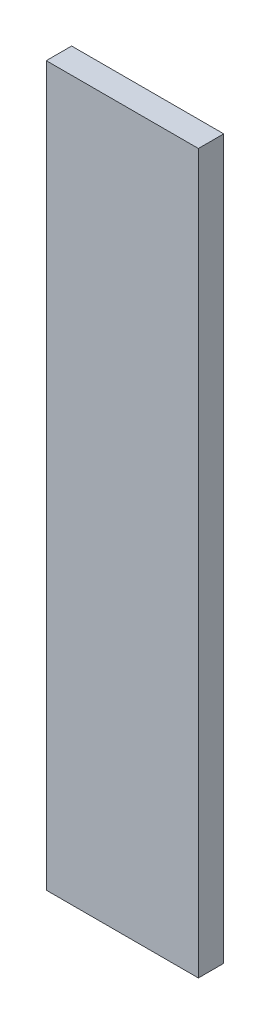
ISO-10303-21;
HEADER;
FILE_DESCRIPTION(('STEP AP214'),'2;1');
FILE_NAME('part.step','',(''),(''),'','','');
FILE_SCHEMA(('AUTOMOTIVE_DESIGN { 1 0 10303 214 1 1 1 1 }'));
ENDSEC;
DATA;
#1=APPLICATION_CONTEXT('core data for automotive mechanical design processes');
#2=APPLICATION_PROTOCOL_DEFINITION('international standard','automotive_design',2000,#1);
#3=PRODUCT_CONTEXT('',#1,'mechanical');
#4=PRODUCT('Part','Part','',(#3));
#5=PRODUCT_RELATED_PRODUCT_CATEGORY('part','',(#4));
#6=PRODUCT_DEFINITION_FORMATION('','',#4);
#7=PRODUCT_DEFINITION_CONTEXT('part definition',#1,'design');
#8=PRODUCT_DEFINITION('design','',#6,#7);
#9=PRODUCT_DEFINITION_SHAPE('','',#8);
#10=(LENGTH_UNIT() NAMED_UNIT(*) SI_UNIT(.MILLI.,.METRE.));
#11=(NAMED_UNIT(*) PLANE_ANGLE_UNIT() SI_UNIT($,.RADIAN.));
#12=(NAMED_UNIT(*) SI_UNIT($,.STERADIAN.) SOLID_ANGLE_UNIT());
#13=UNCERTAINTY_MEASURE_WITH_UNIT(LENGTH_MEASURE(1.E-05),#10,'distance_accuracy_value','');
#14=(GEOMETRIC_REPRESENTATION_CONTEXT(3) GLOBAL_UNCERTAINTY_ASSIGNED_CONTEXT((#13)) GLOBAL_UNIT_ASSIGNED_CONTEXT((#10,
#11,#12)) REPRESENTATION_CONTEXT('',''));
#15=CARTESIAN_POINT('',(0.,0.,0.));
#16=DIRECTION('',(0.,0.,1.));
#17=DIRECTION('',(1.,0.,0.));
#18=AXIS2_PLACEMENT_3D('',#15,#16,#17);
#19=CARTESIAN_POINT('',(-7.73437500000001,7.76953125,3.));
#20=DIRECTION('',(1.,0.,0.));
#21=DIRECTION('',(0.,1.,0.));
#22=AXIS2_PLACEMENT_3D('',#19,#20,#21);
#23=PLANE('',#22);
#24=DIRECTION('',(0.,-1.,0.));
#25=VECTOR('',#24,1.);
#26=CARTESIAN_POINT('',(-7.73437500000001,7.76953125,0.));
#27=LINE('',#26,#25);
#28=CARTESIAN_POINT('',(-7.73437500000001,7.76953125,0.));
#29=VERTEX_POINT('',#28);
#30=CARTESIAN_POINT('',(-7.734375,-77.23046875,0.));
#31=VERTEX_POINT('',#30);
#32=EDGE_CURVE('E96',#29,#31,#27,.T.);
#33=ORIENTED_EDGE('',*,*,#32,.T.);
#34=DIRECTION('',(0.,0.,-1.));
#35=VECTOR('',#34,1.);
#36=CARTESIAN_POINT('',(-7.734375,-77.23046875,3.));
#37=LINE('',#36,#35);
#38=CARTESIAN_POINT('',(-7.734375,-77.23046875,3.));
#39=VERTEX_POINT('',#38);
#40=EDGE_CURVE('E11',#39,#31,#37,.T.);
#41=ORIENTED_EDGE('',*,*,#40,.F.);
#42=DIRECTION('',(0.,-1.,0.));
#43=VECTOR('',#42,1.);
#44=CARTESIAN_POINT('',(-7.73437500000001,7.76953125,3.));
#45=LINE('',#44,#43);
#46=CARTESIAN_POINT('',(-7.73437500000001,7.76953125,3.));
#47=VERTEX_POINT('',#46);
#48=EDGE_CURVE('E84',#47,#39,#45,.T.);
#49=ORIENTED_EDGE('',*,*,#48,.F.);
#50=DIRECTION('',(0.,0.,-1.));
#51=VECTOR('',#50,1.);
#52=CARTESIAN_POINT('',(-7.73437500000001,7.76953125,3.));
#53=LINE('',#52,#51);
#54=EDGE_CURVE('E92',#47,#29,#53,.T.);
#55=ORIENTED_EDGE('',*,*,#54,.T.);
#56=EDGE_LOOP('',(#33,#41,#49,#55));
#57=FACE_BOUND('',#56,.T.);
#58=ADVANCED_FACE('F33',(#57),#23,.F.);
#59=CARTESIAN_POINT('',(-7.734375,-77.23046875,3.));
#60=DIRECTION('',(0.,1.,0.));
#61=DIRECTION('',(0.,0.,1.));
#62=AXIS2_PLACEMENT_3D('',#59,#60,#61);
#63=PLANE('',#62);
#64=DIRECTION('',(1.,0.,0.));
#65=VECTOR('',#64,1.);
#66=CARTESIAN_POINT('',(-7.734375,-77.23046875,0.));
#67=LINE('',#66,#65);
#68=CARTESIAN_POINT('',(10.265625,-77.23046875,0.));
#69=VERTEX_POINT('',#68);
#70=EDGE_CURVE('E88',#31,#69,#67,.T.);
#71=ORIENTED_EDGE('',*,*,#70,.T.);
#72=DIRECTION('',(0.,0.,-1.));
#73=VECTOR('',#72,1.);
#74=CARTESIAN_POINT('',(10.265625,-77.23046875,3.));
#75=LINE('',#74,#73);
#76=CARTESIAN_POINT('',(10.265625,-77.23046875,3.));
#77=VERTEX_POINT('',#76);
#78=EDGE_CURVE('E41',#77,#69,#75,.T.);
#79=ORIENTED_EDGE('',*,*,#78,.F.);
#80=DIRECTION('',(1.,0.,0.));
#81=VECTOR('',#80,1.);
#82=CARTESIAN_POINT('',(-7.734375,-77.23046875,3.));
#83=LINE('',#82,#81);
#84=EDGE_CURVE('E79',#39,#77,#83,.T.);
#85=ORIENTED_EDGE('',*,*,#84,.F.);
#86=ORIENTED_EDGE('',*,*,#40,.T.);
#87=EDGE_LOOP('',(#71,#79,#85,#86));
#88=FACE_BOUND('',#87,.T.);
#89=ADVANCED_FACE('F87',(#88),#63,.F.);
#90=CARTESIAN_POINT('',(10.265625,7.76953125,3.));
#91=DIRECTION('',(-1.,0.,0.));
#92=DIRECTION('',(0.,-1.,0.));
#93=AXIS2_PLACEMENT_3D('',#90,#91,#92);
#94=PLANE('',#93);
#95=DIRECTION('',(0.,1.,0.));
#96=VECTOR('',#95,1.);
#97=CARTESIAN_POINT('',(10.265625,7.76953125,0.));
#98=LINE('',#97,#96);
#99=CARTESIAN_POINT('',(10.265625,7.76953125,0.));
#100=VERTEX_POINT('',#99);
#101=EDGE_CURVE('E66',#69,#100,#98,.T.);
#102=ORIENTED_EDGE('',*,*,#101,.T.);
#103=DIRECTION('',(0.,0.,-1.));
#104=VECTOR('',#103,1.);
#105=CARTESIAN_POINT('',(10.265625,7.76953125,3.));
#106=LINE('',#105,#104);
#107=CARTESIAN_POINT('',(10.265625,7.76953125,3.));
#108=VERTEX_POINT('',#107);
#109=EDGE_CURVE('E89',#108,#100,#106,.T.);
#110=ORIENTED_EDGE('',*,*,#109,.F.);
#111=DIRECTION('',(0.,1.,0.));
#112=VECTOR('',#111,1.);
#113=CARTESIAN_POINT('',(10.265625,7.76953125,3.));
#114=LINE('',#113,#112);
#115=EDGE_CURVE('E82',#77,#108,#114,.T.);
#116=ORIENTED_EDGE('',*,*,#115,.F.);
#117=ORIENTED_EDGE('',*,*,#78,.T.);
#118=EDGE_LOOP('',(#102,#110,#116,#117));
#119=FACE_BOUND('',#118,.T.);
#120=ADVANCED_FACE('F90',(#119),#94,.F.);
#121=CARTESIAN_POINT('',(-7.73437500000001,7.76953125,3.));
#122=DIRECTION('',(0.,-1.,0.));
#123=DIRECTION('',(0.,0.,-1.));
#124=AXIS2_PLACEMENT_3D('',#121,#122,#123);
#125=PLANE('',#124);
#126=DIRECTION('',(-1.,0.,0.));
#127=VECTOR('',#126,1.);
#128=CARTESIAN_POINT('',(-7.73437500000001,7.76953125,0.));
#129=LINE('',#128,#127);
#130=EDGE_CURVE('E72',#100,#29,#129,.T.);
#131=ORIENTED_EDGE('',*,*,#130,.T.);
#132=ORIENTED_EDGE('',*,*,#54,.F.);
#133=DIRECTION('',(-1.,0.,0.));
#134=VECTOR('',#133,1.);
#135=CARTESIAN_POINT('',(-7.73437500000001,7.76953125,3.));
#136=LINE('',#135,#134);
#137=EDGE_CURVE('E49',#108,#47,#136,.T.);
#138=ORIENTED_EDGE('',*,*,#137,.F.);
#139=ORIENTED_EDGE('',*,*,#109,.T.);
#140=EDGE_LOOP('',(#131,#132,#138,#139));
#141=FACE_BOUND('',#140,.T.);
#142=ADVANCED_FACE('F103',(#141),#125,.F.);
#143=CARTESIAN_POINT('',(0.,0.,3.));
#144=DIRECTION('',(0.,0.,1.));
#145=DIRECTION('',(1.,0.,0.));
#146=AXIS2_PLACEMENT_3D('',#143,#144,#145);
#147=PLANE('',#146);
#148=ORIENTED_EDGE('',*,*,#48,.T.);
#149=ORIENTED_EDGE('',*,*,#84,.T.);
#150=ORIENTED_EDGE('',*,*,#115,.T.);
#151=ORIENTED_EDGE('',*,*,#137,.T.);
#152=EDGE_LOOP('',(#148,#149,#150,#151));
#153=FACE_BOUND('',#152,.T.);
#154=ADVANCED_FACE('F80',(#153),#147,.T.);
#155=CARTESIAN_POINT('',(0.,0.,0.));
#156=DIRECTION('',(0.,0.,1.));
#157=DIRECTION('',(1.,0.,0.));
#158=AXIS2_PLACEMENT_3D('',#155,#156,#157);
#159=PLANE('',#158);
#160=ORIENTED_EDGE('',*,*,#32,.F.);
#161=ORIENTED_EDGE('',*,*,#130,.F.);
#162=ORIENTED_EDGE('',*,*,#101,.F.);
#163=ORIENTED_EDGE('',*,*,#70,.F.);
#164=EDGE_LOOP('',(#160,#161,#162,#163));
#165=FACE_BOUND('',#164,.T.);
#166=ADVANCED_FACE('F106',(#165),#159,.F.);
#167=CLOSED_SHELL('',(#58,#89,#120,#142,#154,#166));
#168=MANIFOLD_SOLID_BREP('B2',#167);
#169=ADVANCED_BREP_SHAPE_REPRESENTATION('',(#18,#168),#14);
#170=SHAPE_DEFINITION_REPRESENTATION(#9,#169);
ENDSEC;
END-ISO-10303-21;
